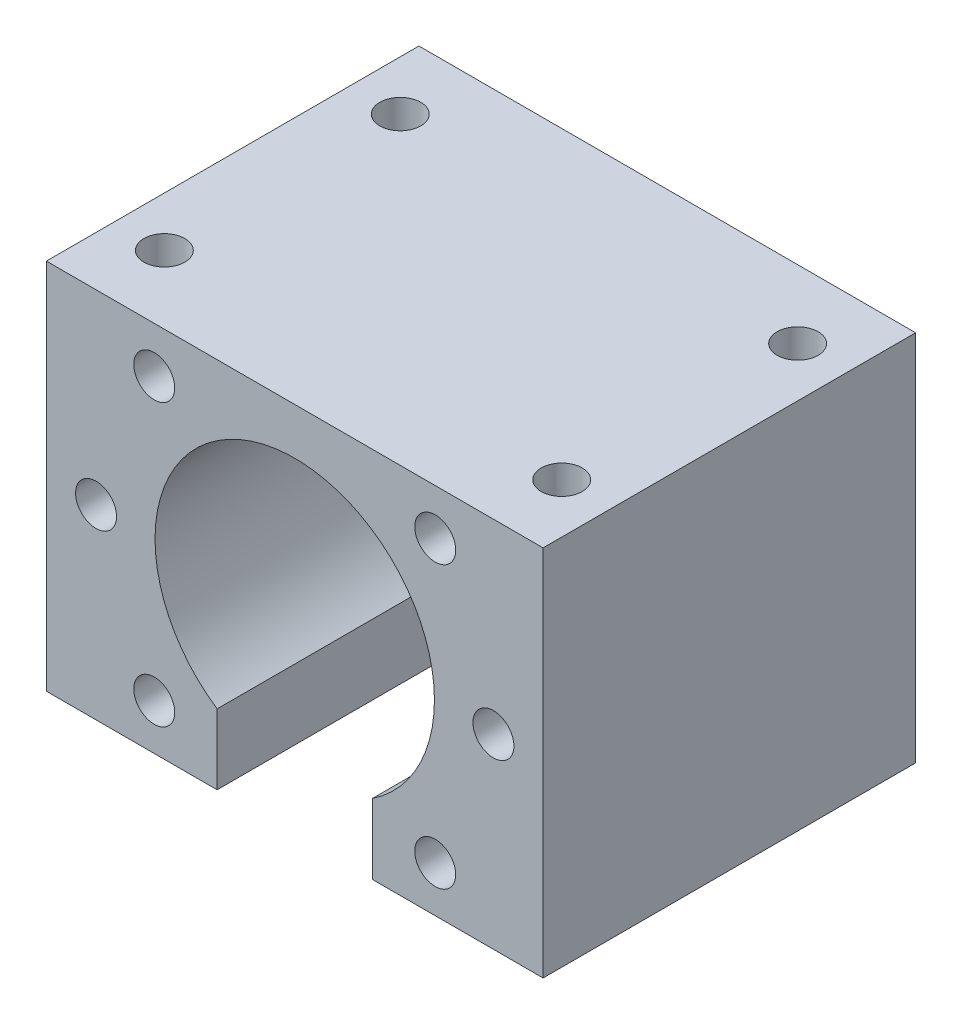
ISO-10303-21;
HEADER;
FILE_DESCRIPTION(('STEP AP214'),'2;1');
FILE_NAME('part.step','',(''),(''),'','','');
FILE_SCHEMA(('AUTOMOTIVE_DESIGN { 1 0 10303 214 1 1 1 1 }'));
ENDSEC;
DATA;
#1=APPLICATION_CONTEXT('core data for automotive mechanical design processes');
#2=APPLICATION_PROTOCOL_DEFINITION('international standard','automotive_design',2000,#1);
#3=PRODUCT_CONTEXT('',#1,'mechanical');
#4=PRODUCT('Part','Part','',(#3));
#5=PRODUCT_RELATED_PRODUCT_CATEGORY('part','',(#4));
#6=PRODUCT_DEFINITION_FORMATION('','',#4);
#7=PRODUCT_DEFINITION_CONTEXT('part definition',#1,'design');
#8=PRODUCT_DEFINITION('design','',#6,#7);
#9=PRODUCT_DEFINITION_SHAPE('','',#8);
#10=(LENGTH_UNIT() NAMED_UNIT(*) SI_UNIT(.MILLI.,.METRE.));
#11=(NAMED_UNIT(*) PLANE_ANGLE_UNIT() SI_UNIT($,.RADIAN.));
#12=(NAMED_UNIT(*) SI_UNIT($,.STERADIAN.) SOLID_ANGLE_UNIT());
#13=UNCERTAINTY_MEASURE_WITH_UNIT(LENGTH_MEASURE(1.E-05),#10,'distance_accuracy_value','');
#14=(GEOMETRIC_REPRESENTATION_CONTEXT(3) GLOBAL_UNCERTAINTY_ASSIGNED_CONTEXT((#13)) GLOBAL_UNIT_ASSIGNED_CONTEXT((#10,
#11,#12)) REPRESENTATION_CONTEXT('',''));
#15=CARTESIAN_POINT('',(0.,0.,0.));
#16=DIRECTION('',(0.,0.,1.));
#17=DIRECTION('',(1.,0.,0.));
#18=AXIS2_PLACEMENT_3D('',#15,#16,#17);
#19=CARTESIAN_POINT('',(20.,-15.,-15.));
#20=DIRECTION('',(0.,-1.,0.));
#21=DIRECTION('',(1.,0.,0.));
#22=AXIS2_PLACEMENT_3D('',#19,#20,#21);
#23=PLANE('',#22);
#24=DIRECTION('',(0.,0.,1.));
#25=VECTOR('',#24,1.);
#26=CARTESIAN_POINT('',(-6.25,-15.,-15.));
#27=LINE('',#26,#25);
#28=CARTESIAN_POINT('',(-6.25,-15.,-15.));
#29=VERTEX_POINT('',#28);
#30=CARTESIAN_POINT('',(-6.25,-15.,15.));
#31=VERTEX_POINT('',#30);
#32=EDGE_CURVE('E222',#29,#31,#27,.T.);
#33=ORIENTED_EDGE('',*,*,#32,.T.);
#34=DIRECTION('',(1.,0.,0.));
#35=VECTOR('',#34,1.);
#36=CARTESIAN_POINT('',(20.,-15.,15.));
#37=LINE('',#36,#35);
#38=CARTESIAN_POINT('',(-20.,-15.,15.));
#39=VERTEX_POINT('',#38);
#40=EDGE_CURVE('E245',#39,#31,#37,.T.);
#41=ORIENTED_EDGE('',*,*,#40,.F.);
#42=DIRECTION('',(0.,0.,1.));
#43=VECTOR('',#42,1.);
#44=CARTESIAN_POINT('',(-20.,-15.,-15.));
#45=LINE('',#44,#43);
#46=CARTESIAN_POINT('',(-20.,-15.,-15.));
#47=VERTEX_POINT('',#46);
#48=EDGE_CURVE('E89',#47,#39,#45,.T.);
#49=ORIENTED_EDGE('',*,*,#48,.F.);
#50=DIRECTION('',(1.,0.,0.));
#51=VECTOR('',#50,1.);
#52=CARTESIAN_POINT('',(20.,-15.,-15.));
#53=LINE('',#52,#51);
#54=EDGE_CURVE('E235',#47,#29,#53,.T.);
#55=ORIENTED_EDGE('',*,*,#54,.T.);
#56=EDGE_LOOP('',(#33,#41,#49,#55));
#57=FACE_BOUND('',#56,.T.);
#58=ADVANCED_FACE('F35',(#57),#23,.T.);
#59=CARTESIAN_POINT('',(-20.,-15.,-15.));
#60=DIRECTION('',(-1.,0.,0.));
#61=DIRECTION('',(0.,0.,1.));
#62=AXIS2_PLACEMENT_3D('',#59,#60,#61);
#63=PLANE('',#62);
#64=DIRECTION('',(0.,-1.,0.));
#65=VECTOR('',#64,1.);
#66=CARTESIAN_POINT('',(-20.,-15.,15.));
#67=LINE('',#66,#65);
#68=CARTESIAN_POINT('',(-20.,15.,15.));
#69=VERTEX_POINT('',#68);
#70=EDGE_CURVE('E225',#69,#39,#67,.T.);
#71=ORIENTED_EDGE('',*,*,#70,.F.);
#72=DIRECTION('',(0.,0.,1.));
#73=VECTOR('',#72,1.);
#74=CARTESIAN_POINT('',(-20.,15.,-15.));
#75=LINE('',#74,#73);
#76=CARTESIAN_POINT('',(-20.,15.,-15.));
#77=VERTEX_POINT('',#76);
#78=EDGE_CURVE('E11',#77,#69,#75,.T.);
#79=ORIENTED_EDGE('',*,*,#78,.F.);
#80=DIRECTION('',(0.,-1.,0.));
#81=VECTOR('',#80,1.);
#82=CARTESIAN_POINT('',(-20.,-15.,-15.));
#83=LINE('',#82,#81);
#84=EDGE_CURVE('E231',#77,#47,#83,.T.);
#85=ORIENTED_EDGE('',*,*,#84,.T.);
#86=ORIENTED_EDGE('',*,*,#48,.T.);
#87=EDGE_LOOP('',(#71,#79,#85,#86));
#88=FACE_BOUND('',#87,.T.);
#89=ADVANCED_FACE('F37',(#88),#63,.T.);
#90=CARTESIAN_POINT('',(20.,15.,-15.));
#91=DIRECTION('',(0.,1.,0.));
#92=DIRECTION('',(-1.,0.,0.));
#93=AXIS2_PLACEMENT_3D('',#90,#91,#92);
#94=PLANE('',#93);
#95=CARTESIAN_POINT('',(-16.,15.,-9.5));
#96=DIRECTION('',(0.,1.,0.));
#97=DIRECTION('',(0.,0.,1.));
#98=AXIS2_PLACEMENT_3D('',#95,#96,#97);
#99=CIRCLE('',#98,1.65);
#100=CARTESIAN_POINT('',(-16.,15.,-7.85));
#101=VERTEX_POINT('',#100);
#102=EDGE_CURVE('E147',#101,#101,#99,.T.);
#103=ORIENTED_EDGE('',*,*,#102,.F.);
#104=EDGE_LOOP('',(#103));
#105=FACE_BOUND('',#104,.T.);
#106=CARTESIAN_POINT('',(-16.,15.,9.5));
#107=DIRECTION('',(0.,1.,0.));
#108=DIRECTION('',(0.,0.,1.));
#109=AXIS2_PLACEMENT_3D('',#106,#107,#108);
#110=CIRCLE('',#109,1.65);
#111=CARTESIAN_POINT('',(-16.,15.,11.15));
#112=VERTEX_POINT('',#111);
#113=EDGE_CURVE('E146',#112,#112,#110,.T.);
#114=ORIENTED_EDGE('',*,*,#113,.F.);
#115=EDGE_LOOP('',(#114));
#116=FACE_BOUND('',#115,.T.);
#117=CARTESIAN_POINT('',(16.,15.,-9.5));
#118=DIRECTION('',(0.,1.,0.));
#119=DIRECTION('',(0.,0.,1.));
#120=AXIS2_PLACEMENT_3D('',#117,#118,#119);
#121=CIRCLE('',#120,1.65);
#122=CARTESIAN_POINT('',(16.,15.,-7.85));
#123=VERTEX_POINT('',#122);
#124=EDGE_CURVE('E157',#123,#123,#121,.T.);
#125=ORIENTED_EDGE('',*,*,#124,.F.);
#126=EDGE_LOOP('',(#125));
#127=FACE_BOUND('',#126,.T.);
#128=CARTESIAN_POINT('',(16.,15.,9.5));
#129=DIRECTION('',(0.,1.,0.));
#130=DIRECTION('',(0.,0.,1.));
#131=AXIS2_PLACEMENT_3D('',#128,#129,#130);
#132=CIRCLE('',#131,1.65);
#133=CARTESIAN_POINT('',(16.,15.,11.15));
#134=VERTEX_POINT('',#133);
#135=EDGE_CURVE('E163',#134,#134,#132,.T.);
#136=ORIENTED_EDGE('',*,*,#135,.F.);
#137=EDGE_LOOP('',(#136));
#138=FACE_BOUND('',#137,.T.);
#139=DIRECTION('',(-1.,0.,0.));
#140=VECTOR('',#139,1.);
#141=CARTESIAN_POINT('',(20.,15.,15.));
#142=LINE('',#141,#140);
#143=CARTESIAN_POINT('',(20.,15.,15.));
#144=VERTEX_POINT('',#143);
#145=EDGE_CURVE('E234',#144,#69,#142,.T.);
#146=ORIENTED_EDGE('',*,*,#145,.F.);
#147=DIRECTION('',(0.,0.,1.));
#148=VECTOR('',#147,1.);
#149=CARTESIAN_POINT('',(20.,15.,-15.));
#150=LINE('',#149,#148);
#151=CARTESIAN_POINT('',(20.,15.,-15.));
#152=VERTEX_POINT('',#151);
#153=EDGE_CURVE('E48',#152,#144,#150,.T.);
#154=ORIENTED_EDGE('',*,*,#153,.F.);
#155=DIRECTION('',(-1.,0.,0.));
#156=VECTOR('',#155,1.);
#157=CARTESIAN_POINT('',(20.,15.,-15.));
#158=LINE('',#157,#156);
#159=EDGE_CURVE('E240',#152,#77,#158,.T.);
#160=ORIENTED_EDGE('',*,*,#159,.T.);
#161=ORIENTED_EDGE('',*,*,#78,.T.);
#162=EDGE_LOOP('',(#146,#154,#160,#161));
#163=FACE_BOUND('',#162,.T.);
#164=ADVANCED_FACE('F315',(#105,#116,#127,#138,#163),#94,.T.);
#165=CARTESIAN_POINT('',(20.,-15.,-15.));
#166=DIRECTION('',(1.,0.,0.));
#167=DIRECTION('',(0.,0.,-1.));
#168=AXIS2_PLACEMENT_3D('',#165,#166,#167);
#169=PLANE('',#168);
#170=DIRECTION('',(0.,1.,0.));
#171=VECTOR('',#170,1.);
#172=CARTESIAN_POINT('',(20.,-15.,15.));
#173=LINE('',#172,#171);
#174=CARTESIAN_POINT('',(20.,-15.,15.));
#175=VERTEX_POINT('',#174);
#176=EDGE_CURVE('E248',#175,#144,#173,.T.);
#177=ORIENTED_EDGE('',*,*,#176,.F.);
#178=DIRECTION('',(0.,0.,1.));
#179=VECTOR('',#178,1.);
#180=CARTESIAN_POINT('',(20.,-15.,-15.));
#181=LINE('',#180,#179);
#182=CARTESIAN_POINT('',(20.,-15.,-15.));
#183=VERTEX_POINT('',#182);
#184=EDGE_CURVE('E254',#183,#175,#181,.T.);
#185=ORIENTED_EDGE('',*,*,#184,.F.);
#186=DIRECTION('',(0.,1.,0.));
#187=VECTOR('',#186,1.);
#188=CARTESIAN_POINT('',(20.,-15.,-15.));
#189=LINE('',#188,#187);
#190=EDGE_CURVE('E237',#183,#152,#189,.T.);
#191=ORIENTED_EDGE('',*,*,#190,.T.);
#192=ORIENTED_EDGE('',*,*,#153,.T.);
#193=EDGE_LOOP('',(#177,#185,#191,#192));
#194=FACE_BOUND('',#193,.T.);
#195=ADVANCED_FACE('F319',(#194),#169,.T.);
#196=DIRECTION('',(0.,0.,1.));
#197=VECTOR('',#196,1.);
#198=CARTESIAN_POINT('',(6.25,-15.,-15.));
#199=LINE('',#198,#197);
#200=CARTESIAN_POINT('',(6.25,-15.,-15.));
#201=VERTEX_POINT('',#200);
#202=CARTESIAN_POINT('',(6.25,-15.,15.));
#203=VERTEX_POINT('',#202);
#204=EDGE_CURVE('E56',#201,#203,#199,.T.);
#205=ORIENTED_EDGE('',*,*,#204,.F.);
#206=EDGE_CURVE('E233',#201,#183,#53,.T.);
#207=ORIENTED_EDGE('',*,*,#206,.T.);
#208=ORIENTED_EDGE('',*,*,#184,.T.);
#209=EDGE_CURVE('E244',#203,#175,#37,.T.);
#210=ORIENTED_EDGE('',*,*,#209,.F.);
#211=EDGE_LOOP('',(#205,#207,#208,#210));
#212=FACE_BOUND('',#211,.T.);
#213=ADVANCED_FACE('F311',(#212),#23,.T.);
#214=CARTESIAN_POINT('',(0.,0.,-15.));
#215=DIRECTION('',(0.,0.,1.));
#216=DIRECTION('',(1.,0.,0.));
#217=AXIS2_PLACEMENT_3D('',#214,#215,#216);
#218=PLANE('',#217);
#219=CARTESIAN_POINT('',(0.,0.,-15.));
#220=DIRECTION('',(0.,0.,1.));
#221=DIRECTION('',(1.,0.,0.));
#222=AXIS2_PLACEMENT_3D('',#219,#220,#221);
#223=CIRCLE('',#222,11.25);
#224=CARTESIAN_POINT('',(6.25,-9.35414346693486,-15.));
#225=VERTEX_POINT('',#224);
#226=CARTESIAN_POINT('',(-6.25,-9.35414346693485,-15.));
#227=VERTEX_POINT('',#226);
#228=EDGE_CURVE('E210',#225,#227,#223,.T.);
#229=ORIENTED_EDGE('',*,*,#228,.T.);
#230=DIRECTION('',(0.,-1.,0.));
#231=VECTOR('',#230,1.);
#232=CARTESIAN_POINT('',(-6.25,-15.,-15.));
#233=LINE('',#232,#231);
#234=EDGE_CURVE('E214',#227,#29,#233,.T.);
#235=ORIENTED_EDGE('',*,*,#234,.T.);
#236=ORIENTED_EDGE('',*,*,#54,.F.);
#237=ORIENTED_EDGE('',*,*,#84,.F.);
#238=ORIENTED_EDGE('',*,*,#159,.F.);
#239=ORIENTED_EDGE('',*,*,#190,.F.);
#240=ORIENTED_EDGE('',*,*,#206,.F.);
#241=DIRECTION('',(0.,1.,0.));
#242=VECTOR('',#241,1.);
#243=CARTESIAN_POINT('',(6.25,-15.,-15.));
#244=LINE('',#243,#242);
#245=EDGE_CURVE('E207',#201,#225,#244,.T.);
#246=ORIENTED_EDGE('',*,*,#245,.T.);
#247=EDGE_LOOP('',(#229,#235,#236,#237,#238,#239,#240,#246));
#248=FACE_BOUND('',#247,.T.);
#249=ADVANCED_FACE('F318',(#248),#218,.F.);
#250=CARTESIAN_POINT('',(0.,0.,15.));
#251=DIRECTION('',(0.,0.,1.));
#252=DIRECTION('',(1.,0.,0.));
#253=AXIS2_PLACEMENT_3D('',#250,#251,#252);
#254=PLANE('',#253);
#255=CARTESIAN_POINT('',(-11.3137084989847,11.3137084989848,15.));
#256=DIRECTION('',(0.,0.,1.));
#257=DIRECTION('',(1.,0.,0.));
#258=AXIS2_PLACEMENT_3D('',#255,#256,#257);
#259=CIRCLE('',#258,1.65);
#260=CARTESIAN_POINT('',(-9.66370849898474,11.3137084989848,15.));
#261=VERTEX_POINT('',#260);
#262=EDGE_CURVE('E170',#261,#261,#259,.T.);
#263=ORIENTED_EDGE('',*,*,#262,.F.);
#264=EDGE_LOOP('',(#263));
#265=FACE_BOUND('',#264,.T.);
#266=CARTESIAN_POINT('',(-16.,0.,15.));
#267=DIRECTION('',(0.,0.,1.));
#268=DIRECTION('',(1.,0.,0.));
#269=AXIS2_PLACEMENT_3D('',#266,#267,#268);
#270=CIRCLE('',#269,1.65);
#271=CARTESIAN_POINT('',(-14.35,0.,15.));
#272=VERTEX_POINT('',#271);
#273=EDGE_CURVE('E176',#272,#272,#270,.T.);
#274=ORIENTED_EDGE('',*,*,#273,.F.);
#275=EDGE_LOOP('',(#274));
#276=FACE_BOUND('',#275,.T.);
#277=CARTESIAN_POINT('',(-11.3137084989847,-11.3137084989848,15.));
#278=DIRECTION('',(0.,0.,1.));
#279=DIRECTION('',(1.,0.,0.));
#280=AXIS2_PLACEMENT_3D('',#277,#278,#279);
#281=CIRCLE('',#280,1.65);
#282=CARTESIAN_POINT('',(-9.66370849898474,-11.3137084989848,15.));
#283=VERTEX_POINT('',#282);
#284=EDGE_CURVE('E182',#283,#283,#281,.T.);
#285=ORIENTED_EDGE('',*,*,#284,.F.);
#286=EDGE_LOOP('',(#285));
#287=FACE_BOUND('',#286,.T.);
#288=CARTESIAN_POINT('',(11.3137084989847,-11.3137084989848,15.));
#289=DIRECTION('',(0.,0.,1.));
#290=DIRECTION('',(1.,0.,0.));
#291=AXIS2_PLACEMENT_3D('',#288,#289,#290);
#292=CIRCLE('',#291,1.65);
#293=CARTESIAN_POINT('',(12.9637084989847,-11.3137084989848,15.));
#294=VERTEX_POINT('',#293);
#295=EDGE_CURVE('E188',#294,#294,#292,.T.);
#296=ORIENTED_EDGE('',*,*,#295,.F.);
#297=EDGE_LOOP('',(#296));
#298=FACE_BOUND('',#297,.T.);
#299=CARTESIAN_POINT('',(16.,0.,15.));
#300=DIRECTION('',(0.,0.,1.));
#301=DIRECTION('',(1.,0.,0.));
#302=AXIS2_PLACEMENT_3D('',#299,#300,#301);
#303=CIRCLE('',#302,1.65);
#304=CARTESIAN_POINT('',(17.65,0.,15.));
#305=VERTEX_POINT('',#304);
#306=EDGE_CURVE('E194',#305,#305,#303,.T.);
#307=ORIENTED_EDGE('',*,*,#306,.F.);
#308=EDGE_LOOP('',(#307));
#309=FACE_BOUND('',#308,.T.);
#310=CARTESIAN_POINT('',(11.3137084989847,11.3137084989848,15.));
#311=DIRECTION('',(0.,0.,1.));
#312=DIRECTION('',(1.,0.,0.));
#313=AXIS2_PLACEMENT_3D('',#310,#311,#312);
#314=CIRCLE('',#313,1.65);
#315=CARTESIAN_POINT('',(12.9637084989847,11.3137084989848,15.));
#316=VERTEX_POINT('',#315);
#317=EDGE_CURVE('E200',#316,#316,#314,.T.);
#318=ORIENTED_EDGE('',*,*,#317,.F.);
#319=EDGE_LOOP('',(#318));
#320=FACE_BOUND('',#319,.T.);
#321=DIRECTION('',(0.,-1.,0.));
#322=VECTOR('',#321,1.);
#323=CARTESIAN_POINT('',(-6.25,-15.,15.));
#324=LINE('',#323,#322);
#325=CARTESIAN_POINT('',(-6.25,-9.35414346693485,15.));
#326=VERTEX_POINT('',#325);
#327=EDGE_CURVE('E211',#326,#31,#324,.T.);
#328=ORIENTED_EDGE('',*,*,#327,.F.);
#329=CARTESIAN_POINT('',(0.,0.,15.));
#330=DIRECTION('',(0.,0.,1.));
#331=DIRECTION('',(1.,0.,0.));
#332=AXIS2_PLACEMENT_3D('',#329,#330,#331);
#333=CIRCLE('',#332,11.25);
#334=CARTESIAN_POINT('',(6.25,-9.35414346693486,15.));
#335=VERTEX_POINT('',#334);
#336=EDGE_CURVE('E218',#335,#326,#333,.T.);
#337=ORIENTED_EDGE('',*,*,#336,.F.);
#338=DIRECTION('',(0.,1.,0.));
#339=VECTOR('',#338,1.);
#340=CARTESIAN_POINT('',(6.25,-15.,15.));
#341=LINE('',#340,#339);
#342=EDGE_CURVE('E206',#203,#335,#341,.T.);
#343=ORIENTED_EDGE('',*,*,#342,.F.);
#344=ORIENTED_EDGE('',*,*,#209,.T.);
#345=ORIENTED_EDGE('',*,*,#176,.T.);
#346=ORIENTED_EDGE('',*,*,#145,.T.);
#347=ORIENTED_EDGE('',*,*,#70,.T.);
#348=ORIENTED_EDGE('',*,*,#40,.T.);
#349=EDGE_LOOP('',(#328,#337,#343,#344,#345,#346,#347,#348));
#350=FACE_BOUND('',#349,.T.);
#351=ADVANCED_FACE('F325',(#265,#276,#287,#298,#309,#320,#350),#254,.T.);
#352=CARTESIAN_POINT('',(-6.25,-15.,-15.));
#353=DIRECTION('',(-1.,0.,0.));
#354=DIRECTION('',(0.,0.,1.));
#355=AXIS2_PLACEMENT_3D('',#352,#353,#354);
#356=PLANE('',#355);
#357=ORIENTED_EDGE('',*,*,#327,.T.);
#358=ORIENTED_EDGE('',*,*,#32,.F.);
#359=ORIENTED_EDGE('',*,*,#234,.F.);
#360=DIRECTION('',(0.,0.,1.));
#361=VECTOR('',#360,1.);
#362=CARTESIAN_POINT('',(-6.25,-9.35414346693485,-15.));
#363=LINE('',#362,#361);
#364=EDGE_CURVE('E226',#227,#326,#363,.T.);
#365=ORIENTED_EDGE('',*,*,#364,.T.);
#366=EDGE_LOOP('',(#357,#358,#359,#365));
#367=FACE_BOUND('',#366,.T.);
#368=ADVANCED_FACE('F346',(#367),#356,.F.);
#369=CARTESIAN_POINT('',(0.,0.,-15.));
#370=DIRECTION('',(0.,0.,1.));
#371=DIRECTION('',(1.,0.,0.));
#372=AXIS2_PLACEMENT_3D('',#369,#370,#371);
#373=CYLINDRICAL_SURFACE('',#372,11.25);
#374=ORIENTED_EDGE('',*,*,#336,.T.);
#375=ORIENTED_EDGE('',*,*,#364,.F.);
#376=ORIENTED_EDGE('',*,*,#228,.F.);
#377=DIRECTION('',(0.,0.,1.));
#378=VECTOR('',#377,1.);
#379=CARTESIAN_POINT('',(6.25,-9.35414346693486,-15.));
#380=LINE('',#379,#378);
#381=EDGE_CURVE('E228',#225,#335,#380,.T.);
#382=ORIENTED_EDGE('',*,*,#381,.T.);
#383=EDGE_LOOP('',(#374,#375,#376,#382));
#384=FACE_BOUND('',#383,.T.);
#385=ADVANCED_FACE('F353',(#384),#373,.F.);
#386=CARTESIAN_POINT('',(6.25,-15.,-15.));
#387=DIRECTION('',(1.,0.,0.));
#388=DIRECTION('',(0.,0.,-1.));
#389=AXIS2_PLACEMENT_3D('',#386,#387,#388);
#390=PLANE('',#389);
#391=ORIENTED_EDGE('',*,*,#342,.T.);
#392=ORIENTED_EDGE('',*,*,#381,.F.);
#393=ORIENTED_EDGE('',*,*,#245,.F.);
#394=ORIENTED_EDGE('',*,*,#204,.T.);
#395=EDGE_LOOP('',(#391,#392,#393,#394));
#396=FACE_BOUND('',#395,.T.);
#397=ADVANCED_FACE('F349',(#396),#390,.F.);
#398=CARTESIAN_POINT('',(11.3137084989847,11.3137084989848,0.));
#399=DIRECTION('',(0.,0.,1.));
#400=DIRECTION('',(1.,0.,0.));
#401=AXIS2_PLACEMENT_3D('',#398,#399,#400);
#402=CONICAL_SURFACE('',#401,1.65,1.02974425867665);
#403=CARTESIAN_POINT('',(11.3137084989847,11.3137084989848,-0.991420021395475));
#404=VERTEX_POINT('',#403);
#405=VERTEX_LOOP('',#404);
#406=FACE_BOUND('',#405,.T.);
#407=CARTESIAN_POINT('',(11.3137084989847,11.3137084989848,0.));
#408=DIRECTION('',(0.,0.,1.));
#409=DIRECTION('',(1.,0.,0.));
#410=AXIS2_PLACEMENT_3D('',#407,#408,#409);
#411=CIRCLE('',#410,1.65);
#412=CARTESIAN_POINT('',(12.9637084989847,11.3137084989848,0.));
#413=VERTEX_POINT('',#412);
#414=EDGE_CURVE('E203',#413,#413,#411,.T.);
#415=ORIENTED_EDGE('',*,*,#414,.T.);
#416=EDGE_LOOP('',(#415));
#417=FACE_BOUND('',#416,.T.);
#418=ADVANCED_FACE('F352',(#406,#417),#402,.F.);
#419=CARTESIAN_POINT('',(11.3137084989847,11.3137084989848,15.));
#420=DIRECTION('',(0.,0.,1.));
#421=DIRECTION('',(1.,0.,0.));
#422=AXIS2_PLACEMENT_3D('',#419,#420,#421);
#423=CYLINDRICAL_SURFACE('',#422,1.65);
#424=ORIENTED_EDGE('',*,*,#414,.F.);
#425=EDGE_LOOP('',(#424));
#426=FACE_BOUND('',#425,.T.);
#427=ORIENTED_EDGE('',*,*,#317,.T.);
#428=EDGE_LOOP('',(#427));
#429=FACE_BOUND('',#428,.T.);
#430=ADVANCED_FACE('F362',(#426,#429),#423,.F.);
#431=CARTESIAN_POINT('',(16.,0.,0.));
#432=DIRECTION('',(0.,0.,1.));
#433=DIRECTION('',(1.,0.,0.));
#434=AXIS2_PLACEMENT_3D('',#431,#432,#433);
#435=CONICAL_SURFACE('',#434,1.65,1.02974425867665);
#436=CARTESIAN_POINT('',(16.,0.,-0.991420021395475));
#437=VERTEX_POINT('',#436);
#438=VERTEX_LOOP('',#437);
#439=FACE_BOUND('',#438,.T.);
#440=CARTESIAN_POINT('',(16.,0.,0.));
#441=DIRECTION('',(0.,0.,1.));
#442=DIRECTION('',(1.,0.,0.));
#443=AXIS2_PLACEMENT_3D('',#440,#441,#442);
#444=CIRCLE('',#443,1.65);
#445=CARTESIAN_POINT('',(17.65,0.,0.));
#446=VERTEX_POINT('',#445);
#447=EDGE_CURVE('E197',#446,#446,#444,.T.);
#448=ORIENTED_EDGE('',*,*,#447,.T.);
#449=EDGE_LOOP('',(#448));
#450=FACE_BOUND('',#449,.T.);
#451=ADVANCED_FACE('F307',(#439,#450),#435,.F.);
#452=CARTESIAN_POINT('',(16.,0.,15.));
#453=DIRECTION('',(0.,0.,1.));
#454=DIRECTION('',(1.,0.,0.));
#455=AXIS2_PLACEMENT_3D('',#452,#453,#454);
#456=CYLINDRICAL_SURFACE('',#455,1.65);
#457=CARTESIAN_POINT('',(15.6586320363794,1.6143010603396,8.55146866958653));
#458=CARTESIAN_POINT('',(15.622134915451,1.60658373233167,8.57825392225265));
#459=CARTESIAN_POINT('',(15.5882284915583,1.59812356270931,8.60840047348702));
#460=CARTESIAN_POINT('',(15.5254806744798,1.5806322614337,8.67351080825146));
#461=CARTESIAN_POINT('',(15.4966599864773,1.571598990489,8.70849329478576));
#462=CARTESIAN_POINT('',(15.4322013189276,1.54974937670179,8.79816251462648));
#463=CARTESIAN_POINT('',(15.3991558809731,1.53702012488344,8.85473905163297));
#464=CARTESIAN_POINT('',(15.3424379298081,1.51362142399208,8.97273314039805));
#465=CARTESIAN_POINT('',(15.3187695769265,1.50295289027063,9.03415282645778));
#466=CARTESIAN_POINT('',(15.2802580938602,1.48490198330983,9.16139558753617));
#467=CARTESIAN_POINT('',(15.2655799175328,1.47758162266094,9.22727766645075));
#468=CARTESIAN_POINT('',(15.2458612996801,1.46761662986541,9.36075189730455));
#469=CARTESIAN_POINT('',(15.2408113994851,1.46496740905591,9.42834230478001));
#470=CARTESIAN_POINT('',(15.2404155549018,1.46476445462192,9.5673364519549));
#471=CARTESIAN_POINT('',(15.2456255118089,1.46750261373446,9.63874299566533));
#472=CARTESIAN_POINT('',(15.2667750648294,1.47818031881829,9.77966742816589));
#473=CARTESIAN_POINT('',(15.2827339223926,1.48612920143989,9.84918169303491));
#474=CARTESIAN_POINT('',(15.3252768116124,1.50592124626977,9.98438924847973));
#475=CARTESIAN_POINT('',(15.3518757632185,1.51776987269696,10.050077024601));
#476=CARTESIAN_POINT('',(15.4159900031582,1.54357708698379,10.1754270121779));
#477=CARTESIAN_POINT('',(15.453480712517,1.55753089046635,10.2351023876251));
#478=CARTESIAN_POINT('',(15.5225227137648,1.57963124003549,10.3226679222999));
#479=CARTESIAN_POINT('',(15.5502413340306,1.58782092185932,10.3535822776477));
#480=CARTESIAN_POINT('',(15.6100542709016,1.60355754717656,10.4110431064231));
#481=CARTESIAN_POINT('',(15.642140782936,1.61110559892041,10.4375971882085));
#482=CARTESIAN_POINT('',(15.7032038372712,1.62331642352414,10.4795959338307));
#483=CARTESIAN_POINT('',(15.7313225889914,1.62824906139763,10.4962000011796));
#484=CARTESIAN_POINT('',(15.7900119510088,1.63685114866812,10.5248100701197));
#485=CARTESIAN_POINT('',(15.8205806776532,1.64052155725211,10.5368195639806));
#486=CARTESIAN_POINT('',(15.8838615364692,1.64621628355115,10.5553393903075));
#487=CARTESIAN_POINT('',(15.9165919556311,1.64822387441394,10.5617938676539));
#488=CARTESIAN_POINT('',(15.9827384258468,1.65024025840967,10.5682768289032));
#489=CARTESIAN_POINT('',(16.0161538316313,1.65025085335943,10.5683111055195));
#490=CARTESIAN_POINT('',(16.0772833241179,1.64842962284867,10.5624551616462));
#491=CARTESIAN_POINT('',(16.1050971295679,1.64687545749887,10.5574577818014));
#492=CARTESIAN_POINT('',(16.1595192040156,1.64249806900478,10.5432605935815));
#493=CARTESIAN_POINT('',(16.1861268792401,1.63967422811531,10.5340587395353));
#494=CARTESIAN_POINT('',(16.2459133153764,1.63193251706352,10.5085177711421));
#495=CARTESIAN_POINT('',(16.2784668623972,1.62663362774046,10.4908366065555));
#496=CARTESIAN_POINT('',(16.340175267149,1.6148601538724,10.4506146245029));
#497=CARTESIAN_POINT('',(16.3693231531623,1.60838322469934,10.4280640985855));
#498=CARTESIAN_POINT('',(16.436018657503,1.59186290581012,10.3687547882655));
#499=CARTESIAN_POINT('',(16.471759618666,1.5814870293155,10.3300651380807));
#500=CARTESIAN_POINT('',(16.5366157103134,1.56067451922507,10.2475122515389));
#501=CARTESIAN_POINT('',(16.5657167803719,1.550237803826,10.20363832973));
#502=CARTESIAN_POINT('',(16.6258605202168,1.52713470178712,10.097826846131));
#503=CARTESIAN_POINT('',(16.6546553529181,1.51479410731326,10.034536282567));
#504=CARTESIAN_POINT('',(16.7019468413123,1.49346626823115,9.90374697526588));
#505=CARTESIAN_POINT('',(16.7204447218986,1.48447862480826,9.83624873312374));
#506=CARTESIAN_POINT('',(16.7471765463182,1.47120875105786,9.69839517567369));
#507=CARTESIAN_POINT('',(16.7553543047894,1.46695229333701,9.62802635556445));
#508=CARTESIAN_POINT('',(16.7610895480651,1.46398578861114,9.48676256647545));
#509=CARTESIAN_POINT('',(16.758650907506,1.46527371808517,9.41586779887825));
#510=CARTESIAN_POINT('',(16.7432022381429,1.47316755405176,9.27533960489697));
#511=CARTESIAN_POINT('',(16.7301600593354,1.47978963315916,9.20571067386649));
#512=CARTESIAN_POINT('',(16.6936154499163,1.49726651362262,9.06973215160674));
#513=CARTESIAN_POINT('',(16.6701045917253,1.50812472430912,9.00338525041223));
#514=CARTESIAN_POINT('',(16.6174060563164,1.53035281653236,8.88683085995636));
#515=CARTESIAN_POINT('',(16.5898646508714,1.54132137396795,8.83579791807674));
#516=CARTESIAN_POINT('',(16.527085604626,1.56390359663967,8.73886733124944));
#517=CARTESIAN_POINT('',(16.4918641710454,1.57551586553092,8.6929591753239));
#518=CARTESIAN_POINT('',(16.4263176730558,1.59420547819051,8.62278795066263));
#519=CARTESIAN_POINT('',(16.398304067754,1.60149900549154,8.59642534177896));
#520=CARTESIAN_POINT('',(16.3384729414841,1.61520111211786,8.54813585966045));
#521=CARTESIAN_POINT('',(16.3066612411513,1.62161101393583,8.52620233418086));
#522=CARTESIAN_POINT('',(16.2463372735569,1.63173224263322,8.49214187962038));
#523=CARTESIAN_POINT('',(16.2184927831635,1.63572745021162,8.47892576074188));
#524=CARTESIAN_POINT('',(16.1609033628832,1.64239069433308,8.45706714372431));
#525=CARTESIAN_POINT('',(16.1311602270398,1.64505996341498,8.44842039760188));
#526=CARTESIAN_POINT('',(16.0702897027064,1.64878550100217,8.43638945298964));
#527=CARTESIAN_POINT('',(16.0391541418631,1.6498304498195,8.43304218293407));
#528=CARTESIAN_POINT('',(15.9767824199274,1.65013106907527,8.43207697917291));
#529=CARTESIAN_POINT('',(15.9455462681781,1.6493869011623,8.43445852786244));
#530=CARTESIAN_POINT('',(15.8873835587476,1.64638273584094,8.44414378455084));
#531=CARTESIAN_POINT('',(15.8603524544057,1.64429271251509,8.4508959536387));
#532=CARTESIAN_POINT('',(15.8076992297165,1.63896943290532,8.46826705984117));
#533=CARTESIAN_POINT('',(15.7820769805815,1.6357362813195,8.47888564283702));
#534=CARTESIAN_POINT('',(15.7399822110477,1.62947843699771,8.49972122267385));
#535=CARTESIAN_POINT('',(15.7230578841237,1.62667858711726,8.50911544793648));
#536=CARTESIAN_POINT('',(15.6901439045913,1.62073082035408,8.52929392705677));
#537=CARTESIAN_POINT('',(15.6741536851408,1.61758311798327,8.54007732491901));
#538=CARTESIAN_POINT('',(15.6586320363794,1.6143010603396,8.55146866958653));
#539=B_SPLINE_CURVE_WITH_KNOTS('',3,(#457,#458,#459,#460,#461,#462,#463,#464,#465,#466,#467,
#468,#469,#470,#471,#472,#473,#474,#475,#476,#477,#478,#479,#480,#481,#482,#483,#484,#485,#486,
#487,#488,#489,#490,#491,#492,#493,#494,#495,#496,#497,#498,#499,#500,#501,#502,#503,#504,#505,
#506,#507,#508,#509,#510,#511,#512,#513,#514,#515,#516,#517,#518,#519,#520,#521,#522,#523,#524,
#525,#526,#527,#528,#529,#530,#531,#532,#533,#534,#535,#536,#537,#538),.UNSPECIFIED.,.T.,.F.,(4,
2,2,2,2,2,2,2,2,2,2,2,2,2,2,2,2,2,2,2,2,2,2,2,2,2,2,2,2,2,2,2,2,2,2,2,2,2,2,2,4),(0.,
0.137704784633214,0.275957873577574,0.475135149454254,0.674400695566358,0.877220707544348,
1.07984136940907,1.29374254883404,1.50802805100473,1.72261509181358,1.93672159537091,
2.06334162244395,2.18973830337847,2.28845442593111,2.38709536598964,2.48671691516493,
2.586248579007,2.67076740187136,2.75532739091222,2.8669735237465,2.97884434468938,
3.13901432940486,3.29952040075672,3.51030977077483,3.72107406058423,3.93298092292752,
4.14481045271865,4.3572846570315,4.56993021913442,4.74639883996557,4.92249860107094,
5.03961419541497,5.15655255823571,5.24943146770985,5.34222387838265,5.43566009418464,
5.5290878682422,5.61256013270339,5.69602475399332,5.75462436008385,5.81318802881888),.UNSPECIFIED.);
#540=CARTESIAN_POINT('',(15.6586320363794,1.6143010603396,8.55146866958653));
#541=VERTEX_POINT('',#540);
#542=EDGE_CURVE('E169',#541,#541,#539,.T.);
#543=ORIENTED_EDGE('',*,*,#542,.T.);
#544=EDGE_LOOP('',(#543));
#545=FACE_BOUND('',#544,.T.);
#546=ORIENTED_EDGE('',*,*,#447,.F.);
#547=EDGE_LOOP('',(#546));
#548=FACE_BOUND('',#547,.T.);
#549=ORIENTED_EDGE('',*,*,#306,.T.);
#550=EDGE_LOOP('',(#549));
#551=FACE_BOUND('',#550,.T.);
#552=ADVANCED_FACE('F262',(#545,#548,#551),#456,.F.);
#553=CARTESIAN_POINT('',(11.3137084989847,-11.3137084989848,0.));
#554=DIRECTION('',(0.,0.,1.));
#555=DIRECTION('',(1.,0.,0.));
#556=AXIS2_PLACEMENT_3D('',#553,#554,#555);
#557=CONICAL_SURFACE('',#556,1.65,1.02974425867665);
#558=CARTESIAN_POINT('',(11.3137084989847,-11.3137084989848,-0.991420021395475));
#559=VERTEX_POINT('',#558);
#560=VERTEX_LOOP('',#559);
#561=FACE_BOUND('',#560,.T.);
#562=CARTESIAN_POINT('',(11.3137084989847,-11.3137084989848,0.));
#563=DIRECTION('',(0.,0.,1.));
#564=DIRECTION('',(1.,0.,0.));
#565=AXIS2_PLACEMENT_3D('',#562,#563,#564);
#566=CIRCLE('',#565,1.65);
#567=CARTESIAN_POINT('',(12.9637084989847,-11.3137084989848,0.));
#568=VERTEX_POINT('',#567);
#569=EDGE_CURVE('E191',#568,#568,#566,.T.);
#570=ORIENTED_EDGE('',*,*,#569,.T.);
#571=EDGE_LOOP('',(#570));
#572=FACE_BOUND('',#571,.T.);
#573=ADVANCED_FACE('F300',(#561,#572),#557,.F.);
#574=CARTESIAN_POINT('',(11.3137084989847,-11.3137084989848,15.));
#575=DIRECTION('',(0.,0.,1.));
#576=DIRECTION('',(1.,0.,0.));
#577=AXIS2_PLACEMENT_3D('',#574,#575,#576);
#578=CYLINDRICAL_SURFACE('',#577,1.65);
#579=ORIENTED_EDGE('',*,*,#569,.F.);
#580=EDGE_LOOP('',(#579));
#581=FACE_BOUND('',#580,.T.);
#582=ORIENTED_EDGE('',*,*,#295,.T.);
#583=EDGE_LOOP('',(#582));
#584=FACE_BOUND('',#583,.T.);
#585=ADVANCED_FACE('F297',(#581,#584),#578,.F.);
#586=CARTESIAN_POINT('',(-11.3137084989847,-11.3137084989848,0.));
#587=DIRECTION('',(0.,0.,1.));
#588=DIRECTION('',(1.,0.,0.));
#589=AXIS2_PLACEMENT_3D('',#586,#587,#588);
#590=CONICAL_SURFACE('',#589,1.65,1.02974425867665);
#591=CARTESIAN_POINT('',(-11.3137084989847,-11.3137084989848,-0.991420021395475));
#592=VERTEX_POINT('',#591);
#593=VERTEX_LOOP('',#592);
#594=FACE_BOUND('',#593,.T.);
#595=CARTESIAN_POINT('',(-11.3137084989847,-11.3137084989848,0.));
#596=DIRECTION('',(0.,0.,1.));
#597=DIRECTION('',(1.,0.,0.));
#598=AXIS2_PLACEMENT_3D('',#595,#596,#597);
#599=CIRCLE('',#598,1.65);
#600=CARTESIAN_POINT('',(-9.66370849898474,-11.3137084989848,0.));
#601=VERTEX_POINT('',#600);
#602=EDGE_CURVE('E185',#601,#601,#599,.T.);
#603=ORIENTED_EDGE('',*,*,#602,.T.);
#604=EDGE_LOOP('',(#603));
#605=FACE_BOUND('',#604,.T.);
#606=ADVANCED_FACE('F293',(#594,#605),#590,.F.);
#607=CARTESIAN_POINT('',(-11.3137084989847,-11.3137084989848,15.));
#608=DIRECTION('',(0.,0.,1.));
#609=DIRECTION('',(1.,0.,0.));
#610=AXIS2_PLACEMENT_3D('',#607,#608,#609);
#611=CYLINDRICAL_SURFACE('',#610,1.65);
#612=ORIENTED_EDGE('',*,*,#602,.F.);
#613=EDGE_LOOP('',(#612));
#614=FACE_BOUND('',#613,.T.);
#615=ORIENTED_EDGE('',*,*,#284,.T.);
#616=EDGE_LOOP('',(#615));
#617=FACE_BOUND('',#616,.T.);
#618=ADVANCED_FACE('F289',(#614,#617),#611,.F.);
#619=CARTESIAN_POINT('',(-16.,0.,0.));
#620=DIRECTION('',(0.,0.,1.));
#621=DIRECTION('',(1.,0.,0.));
#622=AXIS2_PLACEMENT_3D('',#619,#620,#621);
#623=CONICAL_SURFACE('',#622,1.65,1.02974425867665);
#624=CARTESIAN_POINT('',(-16.,0.,-0.991420021395475));
#625=VERTEX_POINT('',#624);
#626=VERTEX_LOOP('',#625);
#627=FACE_BOUND('',#626,.T.);
#628=CARTESIAN_POINT('',(-16.,0.,0.));
#629=DIRECTION('',(0.,0.,1.));
#630=DIRECTION('',(1.,0.,0.));
#631=AXIS2_PLACEMENT_3D('',#628,#629,#630);
#632=CIRCLE('',#631,1.65);
#633=CARTESIAN_POINT('',(-14.35,0.,0.));
#634=VERTEX_POINT('',#633);
#635=EDGE_CURVE('E179',#634,#634,#632,.T.);
#636=ORIENTED_EDGE('',*,*,#635,.T.);
#637=EDGE_LOOP('',(#636));
#638=FACE_BOUND('',#637,.T.);
#639=ADVANCED_FACE('F285',(#627,#638),#623,.F.);
#640=CARTESIAN_POINT('',(-16.,0.,15.));
#641=DIRECTION('',(0.,0.,1.));
#642=DIRECTION('',(1.,0.,0.));
#643=AXIS2_PLACEMENT_3D('',#640,#641,#642);
#644=CYLINDRICAL_SURFACE('',#643,1.65);
#645=CARTESIAN_POINT('',(-16.3413679636206,1.61430106033959,8.55146866958652));
#646=CARTESIAN_POINT('',(-16.377865084549,1.60658373233167,8.57825392225264));
#647=CARTESIAN_POINT('',(-16.4117715084417,1.59812356270931,8.60840047348701));
#648=CARTESIAN_POINT('',(-16.4745193255202,1.5806322614337,8.67351080825146));
#649=CARTESIAN_POINT('',(-16.5033400135227,1.571598990489,8.70849329478576));
#650=CARTESIAN_POINT('',(-16.5677986810724,1.54974937670179,8.79816251462649));
#651=CARTESIAN_POINT('',(-16.6008441190269,1.53702012488343,8.85473905163298));
#652=CARTESIAN_POINT('',(-16.6575620701919,1.51362142399207,8.97273314039805));
#653=CARTESIAN_POINT('',(-16.6812304230735,1.50295289027063,9.03415282645779));
#654=CARTESIAN_POINT('',(-16.7197419061398,1.48490198330983,9.16139558753618));
#655=CARTESIAN_POINT('',(-16.7344200824672,1.47758162266094,9.22727766645077));
#656=CARTESIAN_POINT('',(-16.7541387003199,1.46761662986541,9.36075189730456));
#657=CARTESIAN_POINT('',(-16.7591886005149,1.4649674090559,9.42834230478003));
#658=CARTESIAN_POINT('',(-16.7595844450982,1.46476445462192,9.56733645195492));
#659=CARTESIAN_POINT('',(-16.7543744881911,1.46750261373446,9.63874299566535));
#660=CARTESIAN_POINT('',(-16.7332249351706,1.47818031881829,9.77966742816592));
#661=CARTESIAN_POINT('',(-16.7172660776074,1.48612920143989,9.84918169303493));
#662=CARTESIAN_POINT('',(-16.6747231883876,1.50592124626977,9.98438924847975));
#663=CARTESIAN_POINT('',(-16.6481242367815,1.51776987269696,10.050077024601));
#664=CARTESIAN_POINT('',(-16.5840099968418,1.54357708698379,10.1754270121779));
#665=CARTESIAN_POINT('',(-16.546519287483,1.55753089046636,10.2351023876251));
#666=CARTESIAN_POINT('',(-16.4774772862352,1.5796312400355,10.3226679222999));
#667=CARTESIAN_POINT('',(-16.4497586659694,1.58782092185932,10.3535822776477));
#668=CARTESIAN_POINT('',(-16.3899457290984,1.60355754717656,10.4110431064231));
#669=CARTESIAN_POINT('',(-16.357859217064,1.61110559892041,10.4375971882086));
#670=CARTESIAN_POINT('',(-16.2967961627288,1.62331642352414,10.4795959338307));
#671=CARTESIAN_POINT('',(-16.2686774110086,1.62824906139764,10.4962000011796));
#672=CARTESIAN_POINT('',(-16.2099880489912,1.63685114866812,10.5248100701198));
#673=CARTESIAN_POINT('',(-16.1794193223468,1.64052155725211,10.5368195639806));
#674=CARTESIAN_POINT('',(-16.1161384635308,1.64621628355116,10.5553393903075));
#675=CARTESIAN_POINT('',(-16.0834080443689,1.64822387441394,10.561793867654));
#676=CARTESIAN_POINT('',(-16.0172615741532,1.65024025840967,10.5682768289032));
#677=CARTESIAN_POINT('',(-15.9838461683686,1.65025085335943,10.5683111055195));
#678=CARTESIAN_POINT('',(-15.9227166758821,1.64842962284867,10.5624551616463));
#679=CARTESIAN_POINT('',(-15.8949028704321,1.64687545749887,10.5574577818014));
#680=CARTESIAN_POINT('',(-15.8404807959844,1.64249806900478,10.5432605935815));
#681=CARTESIAN_POINT('',(-15.8138731207599,1.63967422811531,10.5340587395353));
#682=CARTESIAN_POINT('',(-15.7540866846236,1.63193251706352,10.5085177711421));
#683=CARTESIAN_POINT('',(-15.7215331376028,1.62663362774046,10.4908366065555));
#684=CARTESIAN_POINT('',(-15.659824732851,1.6148601538724,10.4506146245029));
#685=CARTESIAN_POINT('',(-15.6306768468377,1.60838322469934,10.4280640985855));
#686=CARTESIAN_POINT('',(-15.563981342497,1.59186290581012,10.3687547882655));
#687=CARTESIAN_POINT('',(-15.528240381334,1.58148702931549,10.3300651380807));
#688=CARTESIAN_POINT('',(-15.4633842896866,1.56067451922507,10.2475122515389));
#689=CARTESIAN_POINT('',(-15.4342832196281,1.550237803826,10.20363832973));
#690=CARTESIAN_POINT('',(-15.3741394797832,1.52713470178711,10.097826846131));
#691=CARTESIAN_POINT('',(-15.3453446470819,1.51479410731325,10.034536282567));
#692=CARTESIAN_POINT('',(-15.2980531586877,1.49346626823115,9.90374697526586));
#693=CARTESIAN_POINT('',(-15.2795552781014,1.48447862480826,9.83624873312372));
#694=CARTESIAN_POINT('',(-15.2528234536818,1.47120875105785,9.69839517567367));
#695=CARTESIAN_POINT('',(-15.2446456952106,1.46695229333701,9.62802635556442));
#696=CARTESIAN_POINT('',(-15.2389104519349,1.46398578861114,9.48676256647542));
#697=CARTESIAN_POINT('',(-15.241349092494,1.46527371808517,9.41586779887822));
#698=CARTESIAN_POINT('',(-15.2567977618571,1.47316755405176,9.27533960489694));
#699=CARTESIAN_POINT('',(-15.2698399406646,1.47978963315916,9.20571067386645));
#700=CARTESIAN_POINT('',(-15.3063845500837,1.49726651362262,9.06973215160671));
#701=CARTESIAN_POINT('',(-15.3298954082747,1.50812472430913,9.0033852504122));
#702=CARTESIAN_POINT('',(-15.3825939436836,1.53035281653237,8.88683085995633));
#703=CARTESIAN_POINT('',(-15.4101353491286,1.54132137396795,8.83579791807671));
#704=CARTESIAN_POINT('',(-15.472914395374,1.56390359663967,8.73886733124941));
#705=CARTESIAN_POINT('',(-15.5081358289546,1.57551586553092,8.69295917532388));
#706=CARTESIAN_POINT('',(-15.5736823269442,1.59420547819052,8.62278795066261));
#707=CARTESIAN_POINT('',(-15.601695932246,1.60149900549155,8.59642534177894));
#708=CARTESIAN_POINT('',(-15.6615270585159,1.61520111211786,8.54813585966043));
#709=CARTESIAN_POINT('',(-15.6933387588487,1.62161101393583,8.52620233418084));
#710=CARTESIAN_POINT('',(-15.7536627264432,1.63173224263322,8.49214187962036));
#711=CARTESIAN_POINT('',(-15.7815072168365,1.63572745021162,8.47892576074187));
#712=CARTESIAN_POINT('',(-15.8390966371168,1.64239069433309,8.4570671437243));
#713=CARTESIAN_POINT('',(-15.8688397729602,1.64505996341499,8.44842039760186));
#714=CARTESIAN_POINT('',(-15.9297102972937,1.64878550100217,8.43638945298963));
#715=CARTESIAN_POINT('',(-15.9608458581369,1.6498304498195,8.43304218293406));
#716=CARTESIAN_POINT('',(-16.0232175800726,1.65013106907527,8.4320769791729));
#717=CARTESIAN_POINT('',(-16.0544537318219,1.64938690116231,8.43445852786244));
#718=CARTESIAN_POINT('',(-16.1126164412524,1.64638273584094,8.44414378455083));
#719=CARTESIAN_POINT('',(-16.1396475455943,1.64429271251509,8.45089595363869));
#720=CARTESIAN_POINT('',(-16.1923007702836,1.63896943290532,8.46826705984117));
#721=CARTESIAN_POINT('',(-16.2179230194185,1.6357362813195,8.47888564283702));
#722=CARTESIAN_POINT('',(-16.2600177889523,1.62947843699771,8.49972122267385));
#723=CARTESIAN_POINT('',(-16.2769421158764,1.62667858711726,8.50911544793648));
#724=CARTESIAN_POINT('',(-16.3098560954088,1.62073082035408,8.52929392705676));
#725=CARTESIAN_POINT('',(-16.3258463148592,1.61758311798327,8.54007732491901));
#726=CARTESIAN_POINT('',(-16.3413679636206,1.61430106033959,8.55146866958652));
#727=B_SPLINE_CURVE_WITH_KNOTS('',3,(#645,#646,#647,#648,#649,#650,#651,#652,#653,#654,#655,
#656,#657,#658,#659,#660,#661,#662,#663,#664,#665,#666,#667,#668,#669,#670,#671,#672,#673,#674,
#675,#676,#677,#678,#679,#680,#681,#682,#683,#684,#685,#686,#687,#688,#689,#690,#691,#692,#693,
#694,#695,#696,#697,#698,#699,#700,#701,#702,#703,#704,#705,#706,#707,#708,#709,#710,#711,#712,
#713,#714,#715,#716,#717,#718,#719,#720,#721,#722,#723,#724,#725,#726),.UNSPECIFIED.,.T.,.F.,(4,
2,2,2,2,2,2,2,2,2,2,2,2,2,2,2,2,2,2,2,2,2,2,2,2,2,2,2,2,2,2,2,2,2,2,2,2,2,2,2,4),(0.,
0.137704784633217,0.27595787357758,0.475135149454262,0.67440069556637,0.877220707544364,
1.07984136940909,1.29374254883407,1.50802805100475,1.7226150918136,1.93672159537094,
2.06334162244398,2.18973830337849,2.28845442593113,2.38709536598966,2.48671691516495,
2.58624857900702,2.67076740187139,2.75532739091224,2.86697352374653,2.97884434468941,
3.1390143294049,3.29952040075676,3.51030977077487,3.72107406058427,3.93298092292758,
4.14481045271871,4.35728465703156,4.56993021913447,4.74639883996563,4.92249860107099,
5.03961419541501,5.15655255823575,5.24943146770989,5.34222387838269,5.43566009418469,
5.52908786824224,5.61256013270344,5.69602475399337,5.75462436008389,5.81318802881892),.UNSPECIFIED.);
#728=CARTESIAN_POINT('',(-16.3413679636206,1.61430106033959,8.55146866958652));
#729=VERTEX_POINT('',#728);
#730=EDGE_CURVE('E39',#729,#729,#727,.T.);
#731=ORIENTED_EDGE('',*,*,#730,.T.);
#732=EDGE_LOOP('',(#731));
#733=FACE_BOUND('',#732,.T.);
#734=ORIENTED_EDGE('',*,*,#635,.F.);
#735=EDGE_LOOP('',(#734));
#736=FACE_BOUND('',#735,.T.);
#737=ORIENTED_EDGE('',*,*,#273,.T.);
#738=EDGE_LOOP('',(#737));
#739=FACE_BOUND('',#738,.T.);
#740=ADVANCED_FACE('F280',(#733,#736,#739),#644,.F.);
#741=CARTESIAN_POINT('',(-11.3137084989847,11.3137084989848,0.));
#742=DIRECTION('',(0.,0.,1.));
#743=DIRECTION('',(1.,0.,0.));
#744=AXIS2_PLACEMENT_3D('',#741,#742,#743);
#745=CONICAL_SURFACE('',#744,1.65,1.02974425867665);
#746=CARTESIAN_POINT('',(-11.3137084989847,11.3137084989848,-0.991420021395475));
#747=VERTEX_POINT('',#746);
#748=VERTEX_LOOP('',#747);
#749=FACE_BOUND('',#748,.T.);
#750=CARTESIAN_POINT('',(-11.3137084989847,11.3137084989848,0.));
#751=DIRECTION('',(0.,0.,1.));
#752=DIRECTION('',(1.,0.,0.));
#753=AXIS2_PLACEMENT_3D('',#750,#751,#752);
#754=CIRCLE('',#753,1.65);
#755=CARTESIAN_POINT('',(-9.66370849898474,11.3137084989848,0.));
#756=VERTEX_POINT('',#755);
#757=EDGE_CURVE('E173',#756,#756,#754,.T.);
#758=ORIENTED_EDGE('',*,*,#757,.T.);
#759=EDGE_LOOP('',(#758));
#760=FACE_BOUND('',#759,.T.);
#761=ADVANCED_FACE('F277',(#749,#760),#745,.F.);
#762=CARTESIAN_POINT('',(-11.3137084989847,11.3137084989848,15.));
#763=DIRECTION('',(0.,0.,1.));
#764=DIRECTION('',(1.,0.,0.));
#765=AXIS2_PLACEMENT_3D('',#762,#763,#764);
#766=CYLINDRICAL_SURFACE('',#765,1.65);
#767=ORIENTED_EDGE('',*,*,#757,.F.);
#768=EDGE_LOOP('',(#767));
#769=FACE_BOUND('',#768,.T.);
#770=ORIENTED_EDGE('',*,*,#262,.T.);
#771=EDGE_LOOP('',(#770));
#772=FACE_BOUND('',#771,.T.);
#773=ADVANCED_FACE('F272',(#769,#772),#766,.F.);
#774=CARTESIAN_POINT('',(16.,2.,9.5));
#775=DIRECTION('',(0.,1.,0.));
#776=DIRECTION('',(0.,0.,1.));
#777=AXIS2_PLACEMENT_3D('',#774,#775,#776);
#778=CONICAL_SURFACE('',#777,1.65,1.02974425867665);
#779=CARTESIAN_POINT('',(16.,2.,9.5));
#780=DIRECTION('',(0.,1.,0.));
#781=DIRECTION('',(0.,0.,1.));
#782=AXIS2_PLACEMENT_3D('',#779,#780,#781);
#783=CIRCLE('',#782,1.65);
#784=CARTESIAN_POINT('',(16.,2.,11.15));
#785=VERTEX_POINT('',#784);
#786=EDGE_CURVE('E166',#785,#785,#783,.T.);
#787=ORIENTED_EDGE('',*,*,#786,.T.);
#788=EDGE_LOOP('',(#787));
#789=FACE_BOUND('',#788,.T.);
#790=ORIENTED_EDGE('',*,*,#542,.F.);
#791=EDGE_LOOP('',(#790));
#792=FACE_BOUND('',#791,.T.);
#793=ADVANCED_FACE('F266',(#789,#792),#778,.F.);
#794=CARTESIAN_POINT('',(16.,15.,9.5));
#795=DIRECTION('',(0.,1.,0.));
#796=DIRECTION('',(0.,0.,1.));
#797=AXIS2_PLACEMENT_3D('',#794,#795,#796);
#798=CYLINDRICAL_SURFACE('',#797,1.65);
#799=ORIENTED_EDGE('',*,*,#786,.F.);
#800=EDGE_LOOP('',(#799));
#801=FACE_BOUND('',#800,.T.);
#802=ORIENTED_EDGE('',*,*,#135,.T.);
#803=EDGE_LOOP('',(#802));
#804=FACE_BOUND('',#803,.T.);
#805=ADVANCED_FACE('F271',(#801,#804),#798,.F.);
#806=CARTESIAN_POINT('',(16.,2.,-9.5));
#807=DIRECTION('',(0.,1.,0.));
#808=DIRECTION('',(0.,0.,1.));
#809=AXIS2_PLACEMENT_3D('',#806,#807,#808);
#810=CONICAL_SURFACE('',#809,1.65,1.02974425867665);
#811=CARTESIAN_POINT('',(16.,1.00857997860453,-9.5));
#812=VERTEX_POINT('',#811);
#813=VERTEX_LOOP('',#812);
#814=FACE_BOUND('',#813,.T.);
#815=CARTESIAN_POINT('',(16.,2.,-9.5));
#816=DIRECTION('',(0.,1.,0.));
#817=DIRECTION('',(0.,0.,1.));
#818=AXIS2_PLACEMENT_3D('',#815,#816,#817);
#819=CIRCLE('',#818,1.65);
#820=CARTESIAN_POINT('',(16.,2.,-7.85));
#821=VERTEX_POINT('',#820);
#822=EDGE_CURVE('E160',#821,#821,#819,.T.);
#823=ORIENTED_EDGE('',*,*,#822,.T.);
#824=EDGE_LOOP('',(#823));
#825=FACE_BOUND('',#824,.T.);
#826=ADVANCED_FACE('F414',(#814,#825),#810,.F.);
#827=CARTESIAN_POINT('',(16.,15.,-9.5));
#828=DIRECTION('',(0.,1.,0.));
#829=DIRECTION('',(0.,0.,1.));
#830=AXIS2_PLACEMENT_3D('',#827,#828,#829);
#831=CYLINDRICAL_SURFACE('',#830,1.65);
#832=ORIENTED_EDGE('',*,*,#822,.F.);
#833=EDGE_LOOP('',(#832));
#834=FACE_BOUND('',#833,.T.);
#835=ORIENTED_EDGE('',*,*,#124,.T.);
#836=EDGE_LOOP('',(#835));
#837=FACE_BOUND('',#836,.T.);
#838=ADVANCED_FACE('F424',(#834,#837),#831,.F.);
#839=CARTESIAN_POINT('',(-16.,2.,9.5));
#840=DIRECTION('',(0.,1.,0.));
#841=DIRECTION('',(0.,0.,1.));
#842=AXIS2_PLACEMENT_3D('',#839,#840,#841);
#843=CONICAL_SURFACE('',#842,1.65,1.02974425867665);
#844=CARTESIAN_POINT('',(-16.,2.,9.5));
#845=DIRECTION('',(0.,1.,0.));
#846=DIRECTION('',(0.,0.,1.));
#847=AXIS2_PLACEMENT_3D('',#844,#845,#846);
#848=CIRCLE('',#847,1.65);
#849=CARTESIAN_POINT('',(-16.,2.,11.15));
#850=VERTEX_POINT('',#849);
#851=EDGE_CURVE('E150',#850,#850,#848,.T.);
#852=ORIENTED_EDGE('',*,*,#851,.T.);
#853=EDGE_LOOP('',(#852));
#854=FACE_BOUND('',#853,.T.);
#855=ORIENTED_EDGE('',*,*,#730,.F.);
#856=EDGE_LOOP('',(#855));
#857=FACE_BOUND('',#856,.T.);
#858=ADVANCED_FACE('F433',(#854,#857),#843,.F.);
#859=CARTESIAN_POINT('',(-16.,15.,9.5));
#860=DIRECTION('',(0.,1.,0.));
#861=DIRECTION('',(0.,0.,1.));
#862=AXIS2_PLACEMENT_3D('',#859,#860,#861);
#863=CYLINDRICAL_SURFACE('',#862,1.65);
#864=ORIENTED_EDGE('',*,*,#851,.F.);
#865=EDGE_LOOP('',(#864));
#866=FACE_BOUND('',#865,.T.);
#867=ORIENTED_EDGE('',*,*,#113,.T.);
#868=EDGE_LOOP('',(#867));
#869=FACE_BOUND('',#868,.T.);
#870=ADVANCED_FACE('F140',(#866,#869),#863,.F.);
#871=CARTESIAN_POINT('',(-16.,2.,-9.5));
#872=DIRECTION('',(0.,1.,0.));
#873=DIRECTION('',(0.,0.,1.));
#874=AXIS2_PLACEMENT_3D('',#871,#872,#873);
#875=CONICAL_SURFACE('',#874,1.65,1.02974425867665);
#876=CARTESIAN_POINT('',(-16.,1.00857997860452,-9.5));
#877=VERTEX_POINT('',#876);
#878=VERTEX_LOOP('',#877);
#879=FACE_BOUND('',#878,.T.);
#880=CARTESIAN_POINT('',(-16.,2.,-9.5));
#881=DIRECTION('',(0.,1.,0.));
#882=DIRECTION('',(0.,0.,1.));
#883=AXIS2_PLACEMENT_3D('',#880,#881,#882);
#884=CIRCLE('',#883,1.65);
#885=CARTESIAN_POINT('',(-16.,2.,-7.85));
#886=VERTEX_POINT('',#885);
#887=EDGE_CURVE('E144',#886,#886,#884,.T.);
#888=ORIENTED_EDGE('',*,*,#887,.T.);
#889=EDGE_LOOP('',(#888));
#890=FACE_BOUND('',#889,.T.);
#891=ADVANCED_FACE('F136',(#879,#890),#875,.F.);
#892=CARTESIAN_POINT('',(-16.,15.,-9.5));
#893=DIRECTION('',(0.,1.,0.));
#894=DIRECTION('',(0.,0.,1.));
#895=AXIS2_PLACEMENT_3D('',#892,#893,#894);
#896=CYLINDRICAL_SURFACE('',#895,1.65);
#897=ORIENTED_EDGE('',*,*,#887,.F.);
#898=EDGE_LOOP('',(#897));
#899=FACE_BOUND('',#898,.T.);
#900=ORIENTED_EDGE('',*,*,#102,.T.);
#901=EDGE_LOOP('',(#900));
#902=FACE_BOUND('',#901,.T.);
#903=ADVANCED_FACE('F139',(#899,#902),#896,.F.);
#904=CLOSED_SHELL('',(#58,#89,#164,#195,#213,#249,#351,#368,#385,#397,#418,#430,#451,#552,#573,
#585,#606,#618,#639,#740,#761,#773,#793,#805,#826,#838,#858,#870,#891,#903));
#905=MANIFOLD_SOLID_BREP('B2',#904);
#906=ADVANCED_BREP_SHAPE_REPRESENTATION('',(#18,#905),#14);
#907=SHAPE_DEFINITION_REPRESENTATION(#9,#906);
ENDSEC;
END-ISO-10303-21;
